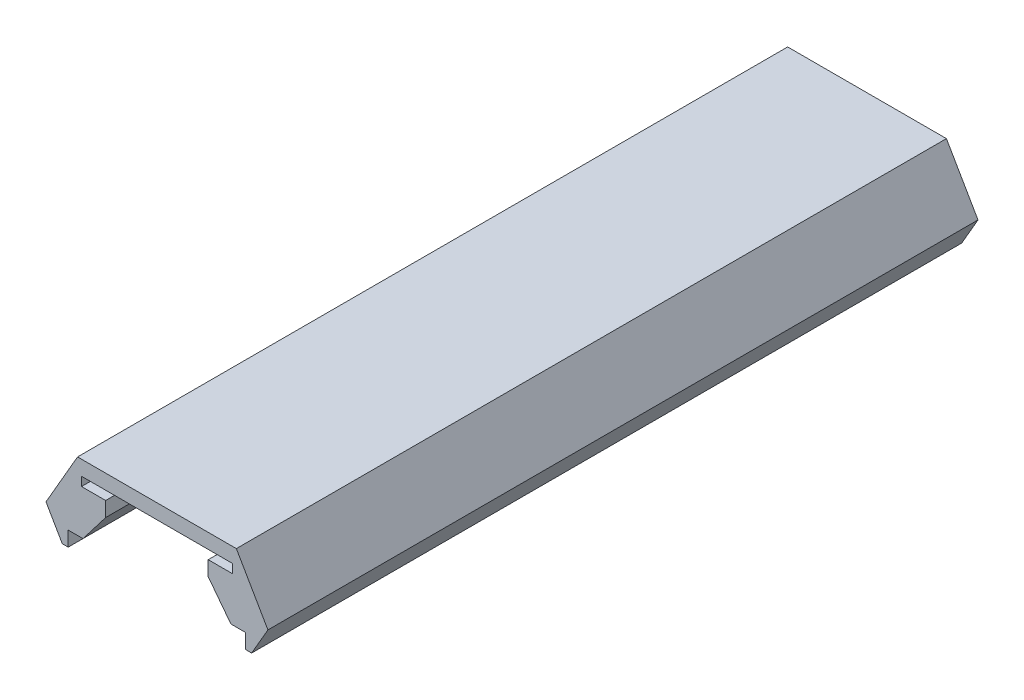
ISO-10303-21;
HEADER;
FILE_DESCRIPTION(('STEP AP214'),'2;1');
FILE_NAME('part.step','',(''),(''),'','','');
FILE_SCHEMA(('AUTOMOTIVE_DESIGN { 1 0 10303 214 1 1 1 1 }'));
ENDSEC;
DATA;
#1=APPLICATION_CONTEXT('core data for automotive mechanical design processes');
#2=APPLICATION_PROTOCOL_DEFINITION('international standard','automotive_design',2000,#1);
#3=PRODUCT_CONTEXT('',#1,'mechanical');
#4=PRODUCT('Part','Part','',(#3));
#5=PRODUCT_RELATED_PRODUCT_CATEGORY('part','',(#4));
#6=PRODUCT_DEFINITION_FORMATION('','',#4);
#7=PRODUCT_DEFINITION_CONTEXT('part definition',#1,'design');
#8=PRODUCT_DEFINITION('design','',#6,#7);
#9=PRODUCT_DEFINITION_SHAPE('','',#8);
#10=(LENGTH_UNIT() NAMED_UNIT(*) SI_UNIT(.MILLI.,.METRE.));
#11=(NAMED_UNIT(*) PLANE_ANGLE_UNIT() SI_UNIT($,.RADIAN.));
#12=(NAMED_UNIT(*) SI_UNIT($,.STERADIAN.) SOLID_ANGLE_UNIT());
#13=UNCERTAINTY_MEASURE_WITH_UNIT(LENGTH_MEASURE(1.E-05),#10,'distance_accuracy_value','');
#14=(GEOMETRIC_REPRESENTATION_CONTEXT(3) GLOBAL_UNCERTAINTY_ASSIGNED_CONTEXT((#13)) GLOBAL_UNIT_ASSIGNED_CONTEXT((#10,
#11,#12)) REPRESENTATION_CONTEXT('',''));
#15=CARTESIAN_POINT('',(0.,0.,0.));
#16=DIRECTION('',(0.,0.,1.));
#17=DIRECTION('',(1.,0.,0.));
#18=AXIS2_PLACEMENT_3D('',#15,#16,#17);
#19=CARTESIAN_POINT('',(5.36683849253808,1.,24.));
#20=DIRECTION('',(0.,-1.,0.));
#21=DIRECTION('',(0.,0.,-1.));
#22=AXIS2_PLACEMENT_3D('',#19,#20,#21);
#23=PLANE('',#22);
#24=DIRECTION('',(-1.,0.,0.));
#25=VECTOR('',#24,1.);
#26=CARTESIAN_POINT('',(5.36683849253808,1.,-24.));
#27=LINE('',#26,#25);
#28=CARTESIAN_POINT('',(5.36683849253808,1.,-24.));
#29=VERTEX_POINT('',#28);
#30=CARTESIAN_POINT('',(-5.36683849253808,1.,-24.));
#31=VERTEX_POINT('',#30);
#32=EDGE_CURVE('E201',#29,#31,#27,.T.);
#33=ORIENTED_EDGE('',*,*,#32,.T.);
#34=DIRECTION('',(0.,0.,-1.));
#35=VECTOR('',#34,1.);
#36=CARTESIAN_POINT('',(-5.36683849253808,1.,24.));
#37=LINE('',#36,#35);
#38=CARTESIAN_POINT('',(-5.36683849253808,1.,24.));
#39=VERTEX_POINT('',#38);
#40=EDGE_CURVE('E11',#39,#31,#37,.T.);
#41=ORIENTED_EDGE('',*,*,#40,.F.);
#42=DIRECTION('',(-1.,0.,0.));
#43=VECTOR('',#42,1.);
#44=CARTESIAN_POINT('',(5.36683849253808,1.,24.));
#45=LINE('',#44,#43);
#46=CARTESIAN_POINT('',(5.36683849253808,1.,24.));
#47=VERTEX_POINT('',#46);
#48=EDGE_CURVE('E239',#47,#39,#45,.T.);
#49=ORIENTED_EDGE('',*,*,#48,.F.);
#50=DIRECTION('',(0.,0.,-1.));
#51=VECTOR('',#50,1.);
#52=CARTESIAN_POINT('',(5.36683849253808,1.,24.));
#53=LINE('',#52,#51);
#54=EDGE_CURVE('E197',#47,#29,#53,.T.);
#55=ORIENTED_EDGE('',*,*,#54,.T.);
#56=EDGE_LOOP('',(#33,#41,#49,#55));
#57=FACE_BOUND('',#56,.T.);
#58=ADVANCED_FACE('F33',(#57),#23,.F.);
#59=CARTESIAN_POINT('',(-5.36683849253808,1.,24.));
#60=DIRECTION('',(0.866025403784437,-0.500000000000004,0.));
#61=DIRECTION('',(0.500000000000004,0.866025403784437,0.));
#62=AXIS2_PLACEMENT_3D('',#59,#60,#61);
#63=PLANE('',#62);
#64=DIRECTION('',(-0.500000000000004,-0.866025403784436,0.));
#65=VECTOR('',#64,1.);
#66=CARTESIAN_POINT('',(-5.36683849253808,1.,-24.));
#67=LINE('',#66,#65);
#68=CARTESIAN_POINT('',(-7.5,-2.69474411167423,-24.));
#69=VERTEX_POINT('',#68);
#70=EDGE_CURVE('E204',#31,#69,#67,.T.);
#71=ORIENTED_EDGE('',*,*,#70,.T.);
#72=DIRECTION('',(0.,0.,-1.));
#73=VECTOR('',#72,1.);
#74=CARTESIAN_POINT('',(-7.5,-2.69474411167423,24.));
#75=LINE('',#74,#73);
#76=CARTESIAN_POINT('',(-7.5,-2.69474411167423,24.));
#77=VERTEX_POINT('',#76);
#78=EDGE_CURVE('E41',#77,#69,#75,.T.);
#79=ORIENTED_EDGE('',*,*,#78,.F.);
#80=DIRECTION('',(-0.500000000000004,-0.866025403784436,0.));
#81=VECTOR('',#80,1.);
#82=CARTESIAN_POINT('',(-5.36683849253808,1.,24.));
#83=LINE('',#82,#81);
#84=EDGE_CURVE('E128',#39,#77,#83,.T.);
#85=ORIENTED_EDGE('',*,*,#84,.F.);
#86=ORIENTED_EDGE('',*,*,#40,.T.);
#87=EDGE_LOOP('',(#71,#79,#85,#86));
#88=FACE_BOUND('',#87,.T.);
#89=ADVANCED_FACE('F357',(#88),#63,.F.);
#90=CARTESIAN_POINT('',(-7.5,-2.69474411167423,24.));
#91=DIRECTION('',(0.86602540378444,0.499999999999998,0.));
#92=DIRECTION('',(-0.499999999999998,0.86602540378444,0.));
#93=AXIS2_PLACEMENT_3D('',#90,#91,#92);
#94=PLANE('',#93);
#95=DIRECTION('',(0.499999999999998,-0.86602540378444,0.));
#96=VECTOR('',#95,1.);
#97=CARTESIAN_POINT('',(-7.5,-2.69474411167423,-24.));
#98=LINE('',#97,#96);
#99=CARTESIAN_POINT('',(-6.4,-4.6,-24.));
#100=VERTEX_POINT('',#99);
#101=EDGE_CURVE('E206',#69,#100,#98,.T.);
#102=ORIENTED_EDGE('',*,*,#101,.T.);
#103=DIRECTION('',(0.,0.,-1.));
#104=VECTOR('',#103,1.);
#105=CARTESIAN_POINT('',(-6.4,-4.6,24.));
#106=LINE('',#105,#104);
#107=CARTESIAN_POINT('',(-6.4,-4.6,24.));
#108=VERTEX_POINT('',#107);
#109=EDGE_CURVE('E282',#108,#100,#106,.T.);
#110=ORIENTED_EDGE('',*,*,#109,.F.);
#111=DIRECTION('',(0.499999999999998,-0.86602540378444,0.));
#112=VECTOR('',#111,1.);
#113=CARTESIAN_POINT('',(-7.5,-2.69474411167423,24.));
#114=LINE('',#113,#112);
#115=EDGE_CURVE('E290',#77,#108,#114,.T.);
#116=ORIENTED_EDGE('',*,*,#115,.F.);
#117=ORIENTED_EDGE('',*,*,#78,.T.);
#118=EDGE_LOOP('',(#102,#110,#116,#117));
#119=FACE_BOUND('',#118,.T.);
#120=ADVANCED_FACE('F288',(#119),#94,.F.);
#121=CARTESIAN_POINT('',(-6.4,-4.6,24.));
#122=DIRECTION('',(0.,1.,0.));
#123=DIRECTION('',(0.,0.,1.));
#124=AXIS2_PLACEMENT_3D('',#121,#122,#123);
#125=PLANE('',#124);
#126=DIRECTION('',(1.,0.,0.));
#127=VECTOR('',#126,1.);
#128=CARTESIAN_POINT('',(-6.4,-4.6,-24.));
#129=LINE('',#128,#127);
#130=CARTESIAN_POINT('',(-6.,-4.6,-24.));
#131=VERTEX_POINT('',#130);
#132=EDGE_CURVE('E208',#100,#131,#129,.T.);
#133=ORIENTED_EDGE('',*,*,#132,.T.);
#134=DIRECTION('',(0.,0.,-1.));
#135=VECTOR('',#134,1.);
#136=CARTESIAN_POINT('',(-6.,-4.6,24.));
#137=LINE('',#136,#135);
#138=CARTESIAN_POINT('',(-6.,-4.6,24.));
#139=VERTEX_POINT('',#138);
#140=EDGE_CURVE('E279',#139,#131,#137,.T.);
#141=ORIENTED_EDGE('',*,*,#140,.F.);
#142=DIRECTION('',(1.,0.,0.));
#143=VECTOR('',#142,1.);
#144=CARTESIAN_POINT('',(-6.4,-4.6,24.));
#145=LINE('',#144,#143);
#146=EDGE_CURVE('E308',#108,#139,#145,.T.);
#147=ORIENTED_EDGE('',*,*,#146,.F.);
#148=ORIENTED_EDGE('',*,*,#109,.T.);
#149=EDGE_LOOP('',(#133,#141,#147,#148));
#150=FACE_BOUND('',#149,.T.);
#151=ADVANCED_FACE('F299',(#150),#125,.F.);
#152=CARTESIAN_POINT('',(-6.,-4.6,24.));
#153=DIRECTION('',(-1.,0.,0.));
#154=DIRECTION('',(0.,0.,1.));
#155=AXIS2_PLACEMENT_3D('',#152,#153,#154);
#156=PLANE('',#155);
#157=DIRECTION('',(0.,1.,0.));
#158=VECTOR('',#157,1.);
#159=CARTESIAN_POINT('',(-6.,-4.6,-24.));
#160=LINE('',#159,#158);
#161=CARTESIAN_POINT('',(-6.,-3.6,-24.));
#162=VERTEX_POINT('',#161);
#163=EDGE_CURVE('E210',#131,#162,#160,.T.);
#164=ORIENTED_EDGE('',*,*,#163,.T.);
#165=DIRECTION('',(0.,0.,-1.));
#166=VECTOR('',#165,1.);
#167=CARTESIAN_POINT('',(-6.,-3.6,24.));
#168=LINE('',#167,#166);
#169=CARTESIAN_POINT('',(-6.,-3.6,24.));
#170=VERTEX_POINT('',#169);
#171=EDGE_CURVE('E276',#170,#162,#168,.T.);
#172=ORIENTED_EDGE('',*,*,#171,.F.);
#173=DIRECTION('',(0.,1.,0.));
#174=VECTOR('',#173,1.);
#175=CARTESIAN_POINT('',(-6.,-4.6,24.));
#176=LINE('',#175,#174);
#177=EDGE_CURVE('E305',#139,#170,#176,.T.);
#178=ORIENTED_EDGE('',*,*,#177,.F.);
#179=ORIENTED_EDGE('',*,*,#140,.T.);
#180=EDGE_LOOP('',(#164,#172,#178,#179));
#181=FACE_BOUND('',#180,.T.);
#182=ADVANCED_FACE('F303',(#181),#156,.F.);
#183=CARTESIAN_POINT('',(-6.,-3.6,24.));
#184=DIRECTION('',(0.,1.,0.));
#185=DIRECTION('',(0.,0.,1.));
#186=AXIS2_PLACEMENT_3D('',#183,#184,#185);
#187=PLANE('',#186);
#188=DIRECTION('',(1.,0.,0.));
#189=VECTOR('',#188,1.);
#190=CARTESIAN_POINT('',(-6.,-3.6,-24.));
#191=LINE('',#190,#189);
#192=CARTESIAN_POINT('',(-5.,-3.6,-24.));
#193=VERTEX_POINT('',#192);
#194=EDGE_CURVE('E212',#162,#193,#191,.T.);
#195=ORIENTED_EDGE('',*,*,#194,.T.);
#196=DIRECTION('',(0.,0.,-1.));
#197=VECTOR('',#196,1.);
#198=CARTESIAN_POINT('',(-5.,-3.6,24.));
#199=LINE('',#198,#197);
#200=CARTESIAN_POINT('',(-5.,-3.6,24.));
#201=VERTEX_POINT('',#200);
#202=EDGE_CURVE('E273',#201,#193,#199,.T.);
#203=ORIENTED_EDGE('',*,*,#202,.F.);
#204=DIRECTION('',(1.,0.,0.));
#205=VECTOR('',#204,1.);
#206=CARTESIAN_POINT('',(-6.,-3.6,24.));
#207=LINE('',#206,#205);
#208=EDGE_CURVE('E307',#170,#201,#207,.T.);
#209=ORIENTED_EDGE('',*,*,#208,.F.);
#210=ORIENTED_EDGE('',*,*,#171,.T.);
#211=EDGE_LOOP('',(#195,#203,#209,#210));
#212=FACE_BOUND('',#211,.T.);
#213=ADVANCED_FACE('F370',(#212),#187,.F.);
#214=CARTESIAN_POINT('',(-5.,-3.6,24.));
#215=DIRECTION('',(-0.793656614758769,0.60836599005011,0.));
#216=DIRECTION('',(-0.60836599005011,-0.793656614758769,0.));
#217=AXIS2_PLACEMENT_3D('',#214,#215,#216);
#218=PLANE('',#217);
#219=DIRECTION('',(0.60836599005011,0.793656614758769,0.));
#220=VECTOR('',#219,1.);
#221=CARTESIAN_POINT('',(-5.,-3.6,-24.));
#222=LINE('',#221,#220);
#223=CARTESIAN_POINT('',(-3.46692894953059,-1.6,-24.));
#224=VERTEX_POINT('',#223);
#225=EDGE_CURVE('E214',#193,#224,#222,.T.);
#226=ORIENTED_EDGE('',*,*,#225,.T.);
#227=DIRECTION('',(0.,0.,-1.));
#228=VECTOR('',#227,1.);
#229=CARTESIAN_POINT('',(-3.46692894953059,-1.6,24.));
#230=LINE('',#229,#228);
#231=CARTESIAN_POINT('',(-3.46692894953059,-1.6,24.));
#232=VERTEX_POINT('',#231);
#233=EDGE_CURVE('E270',#232,#224,#230,.T.);
#234=ORIENTED_EDGE('',*,*,#233,.F.);
#235=DIRECTION('',(0.60836599005011,0.793656614758769,0.));
#236=VECTOR('',#235,1.);
#237=CARTESIAN_POINT('',(-5.,-3.6,24.));
#238=LINE('',#237,#236);
#239=EDGE_CURVE('E310',#201,#232,#238,.T.);
#240=ORIENTED_EDGE('',*,*,#239,.F.);
#241=ORIENTED_EDGE('',*,*,#202,.T.);
#242=EDGE_LOOP('',(#226,#234,#240,#241));
#243=FACE_BOUND('',#242,.T.);
#244=ADVANCED_FACE('F373',(#243),#218,.F.);
#245=CARTESIAN_POINT('',(-3.46692894953059,-1.6,24.));
#246=DIRECTION('',(-1.,0.,0.));
#247=DIRECTION('',(0.,-1.,0.));
#248=AXIS2_PLACEMENT_3D('',#245,#246,#247);
#249=PLANE('',#248);
#250=DIRECTION('',(0.,1.,0.));
#251=VECTOR('',#250,1.);
#252=CARTESIAN_POINT('',(-3.46692894953059,-1.6,-24.));
#253=LINE('',#252,#251);
#254=CARTESIAN_POINT('',(-3.46692894953059,-0.6,-24.));
#255=VERTEX_POINT('',#254);
#256=EDGE_CURVE('E216',#224,#255,#253,.T.);
#257=ORIENTED_EDGE('',*,*,#256,.T.);
#258=DIRECTION('',(0.,0.,-1.));
#259=VECTOR('',#258,1.);
#260=CARTESIAN_POINT('',(-3.46692894953059,-0.6,24.));
#261=LINE('',#260,#259);
#262=CARTESIAN_POINT('',(-3.46692894953059,-0.6,24.));
#263=VERTEX_POINT('',#262);
#264=EDGE_CURVE('E267',#263,#255,#261,.T.);
#265=ORIENTED_EDGE('',*,*,#264,.F.);
#266=DIRECTION('',(0.,1.,0.));
#267=VECTOR('',#266,1.);
#268=CARTESIAN_POINT('',(-3.46692894953059,-1.6,24.));
#269=LINE('',#268,#267);
#270=EDGE_CURVE('E316',#232,#263,#269,.T.);
#271=ORIENTED_EDGE('',*,*,#270,.F.);
#272=ORIENTED_EDGE('',*,*,#233,.T.);
#273=EDGE_LOOP('',(#257,#265,#271,#272));
#274=FACE_BOUND('',#273,.T.);
#275=ADVANCED_FACE('F377',(#274),#249,.F.);
#276=CARTESIAN_POINT('',(-3.46692894953059,-0.6,24.));
#277=DIRECTION('',(0.,-1.,0.));
#278=DIRECTION('',(1.,0.,0.));
#279=AXIS2_PLACEMENT_3D('',#276,#277,#278);
#280=PLANE('',#279);
#281=DIRECTION('',(-1.,0.,0.));
#282=VECTOR('',#281,1.);
#283=CARTESIAN_POINT('',(-3.46692894953059,-0.6,-24.));
#284=LINE('',#283,#282);
#285=CARTESIAN_POINT('',(-5.1,-0.6,-24.));
#286=VERTEX_POINT('',#285);
#287=EDGE_CURVE('E218',#255,#286,#284,.T.);
#288=ORIENTED_EDGE('',*,*,#287,.T.);
#289=DIRECTION('',(0.,0.,-1.));
#290=VECTOR('',#289,1.);
#291=CARTESIAN_POINT('',(-5.1,-0.6,24.));
#292=LINE('',#291,#290);
#293=CARTESIAN_POINT('',(-5.1,-0.6,24.));
#294=VERTEX_POINT('',#293);
#295=EDGE_CURVE('E264',#294,#286,#292,.T.);
#296=ORIENTED_EDGE('',*,*,#295,.F.);
#297=DIRECTION('',(-1.,0.,0.));
#298=VECTOR('',#297,1.);
#299=CARTESIAN_POINT('',(-3.46692894953059,-0.6,24.));
#300=LINE('',#299,#298);
#301=EDGE_CURVE('E318',#263,#294,#300,.T.);
#302=ORIENTED_EDGE('',*,*,#301,.F.);
#303=ORIENTED_EDGE('',*,*,#264,.T.);
#304=EDGE_LOOP('',(#288,#296,#302,#303));
#305=FACE_BOUND('',#304,.T.);
#306=ADVANCED_FACE('F381',(#305),#280,.F.);
#307=CARTESIAN_POINT('',(-5.1,-0.6,24.));
#308=DIRECTION('',(-1.,0.,0.));
#309=DIRECTION('',(0.,0.,1.));
#310=AXIS2_PLACEMENT_3D('',#307,#308,#309);
#311=PLANE('',#310);
#312=DIRECTION('',(0.,1.,0.));
#313=VECTOR('',#312,1.);
#314=CARTESIAN_POINT('',(-5.1,-0.6,-24.));
#315=LINE('',#314,#313);
#316=CARTESIAN_POINT('',(-5.1,0.,-24.));
#317=VERTEX_POINT('',#316);
#318=EDGE_CURVE('E220',#286,#317,#315,.T.);
#319=ORIENTED_EDGE('',*,*,#318,.T.);
#320=DIRECTION('',(0.,0.,-1.));
#321=VECTOR('',#320,1.);
#322=CARTESIAN_POINT('',(-5.1,0.,24.));
#323=LINE('',#322,#321);
#324=CARTESIAN_POINT('',(-5.1,0.,24.));
#325=VERTEX_POINT('',#324);
#326=EDGE_CURVE('E261',#325,#317,#323,.T.);
#327=ORIENTED_EDGE('',*,*,#326,.F.);
#328=DIRECTION('',(0.,1.,0.));
#329=VECTOR('',#328,1.);
#330=CARTESIAN_POINT('',(-5.1,-0.6,24.));
#331=LINE('',#330,#329);
#332=EDGE_CURVE('E320',#294,#325,#331,.T.);
#333=ORIENTED_EDGE('',*,*,#332,.F.);
#334=ORIENTED_EDGE('',*,*,#295,.T.);
#335=EDGE_LOOP('',(#319,#327,#333,#334));
#336=FACE_BOUND('',#335,.T.);
#337=ADVANCED_FACE('F385',(#336),#311,.F.);
#338=CARTESIAN_POINT('',(-5.1,0.,24.));
#339=DIRECTION('',(0.,1.,0.));
#340=DIRECTION('',(0.,0.,1.));
#341=AXIS2_PLACEMENT_3D('',#338,#339,#340);
#342=PLANE('',#341);
#343=DIRECTION('',(1.,0.,0.));
#344=VECTOR('',#343,1.);
#345=CARTESIAN_POINT('',(-5.1,0.,-24.));
#346=LINE('',#345,#344);
#347=CARTESIAN_POINT('',(5.1,0.,-24.));
#348=VERTEX_POINT('',#347);
#349=EDGE_CURVE('E222',#317,#348,#346,.T.);
#350=ORIENTED_EDGE('',*,*,#349,.T.);
#351=DIRECTION('',(0.,0.,-1.));
#352=VECTOR('',#351,1.);
#353=CARTESIAN_POINT('',(5.1,0.,24.));
#354=LINE('',#353,#352);
#355=CARTESIAN_POINT('',(5.1,0.,24.));
#356=VERTEX_POINT('',#355);
#357=EDGE_CURVE('E258',#356,#348,#354,.T.);
#358=ORIENTED_EDGE('',*,*,#357,.F.);
#359=DIRECTION('',(1.,0.,0.));
#360=VECTOR('',#359,1.);
#361=CARTESIAN_POINT('',(-5.1,0.,24.));
#362=LINE('',#361,#360);
#363=EDGE_CURVE('E322',#325,#356,#362,.T.);
#364=ORIENTED_EDGE('',*,*,#363,.F.);
#365=ORIENTED_EDGE('',*,*,#326,.T.);
#366=EDGE_LOOP('',(#350,#358,#364,#365));
#367=FACE_BOUND('',#366,.T.);
#368=ADVANCED_FACE('F389',(#367),#342,.F.);
#369=CARTESIAN_POINT('',(5.1,0.,24.));
#370=DIRECTION('',(1.,0.,0.));
#371=DIRECTION('',(0.,0.,-1.));
#372=AXIS2_PLACEMENT_3D('',#369,#370,#371);
#373=PLANE('',#372);
#374=DIRECTION('',(0.,-1.,0.));
#375=VECTOR('',#374,1.);
#376=CARTESIAN_POINT('',(5.1,0.,-24.));
#377=LINE('',#376,#375);
#378=CARTESIAN_POINT('',(5.1,-0.6,-24.));
#379=VERTEX_POINT('',#378);
#380=EDGE_CURVE('E224',#348,#379,#377,.T.);
#381=ORIENTED_EDGE('',*,*,#380,.T.);
#382=DIRECTION('',(0.,0.,-1.));
#383=VECTOR('',#382,1.);
#384=CARTESIAN_POINT('',(5.1,-0.6,24.));
#385=LINE('',#384,#383);
#386=CARTESIAN_POINT('',(5.1,-0.6,24.));
#387=VERTEX_POINT('',#386);
#388=EDGE_CURVE('E255',#387,#379,#385,.T.);
#389=ORIENTED_EDGE('',*,*,#388,.F.);
#390=DIRECTION('',(0.,-1.,0.));
#391=VECTOR('',#390,1.);
#392=CARTESIAN_POINT('',(5.1,0.,24.));
#393=LINE('',#392,#391);
#394=EDGE_CURVE('E324',#356,#387,#393,.T.);
#395=ORIENTED_EDGE('',*,*,#394,.F.);
#396=ORIENTED_EDGE('',*,*,#357,.T.);
#397=EDGE_LOOP('',(#381,#389,#395,#396));
#398=FACE_BOUND('',#397,.T.);
#399=ADVANCED_FACE('F393',(#398),#373,.F.);
#400=CARTESIAN_POINT('',(5.1,-0.6,24.));
#401=DIRECTION('',(0.,-1.,0.));
#402=DIRECTION('',(1.,0.,0.));
#403=AXIS2_PLACEMENT_3D('',#400,#401,#402);
#404=PLANE('',#403);
#405=DIRECTION('',(-1.,0.,0.));
#406=VECTOR('',#405,1.);
#407=CARTESIAN_POINT('',(5.1,-0.6,-24.));
#408=LINE('',#407,#406);
#409=CARTESIAN_POINT('',(3.46692894953059,-0.6,-24.));
#410=VERTEX_POINT('',#409);
#411=EDGE_CURVE('E226',#379,#410,#408,.T.);
#412=ORIENTED_EDGE('',*,*,#411,.T.);
#413=DIRECTION('',(0.,0.,-1.));
#414=VECTOR('',#413,1.);
#415=CARTESIAN_POINT('',(3.46692894953059,-0.6,24.));
#416=LINE('',#415,#414);
#417=CARTESIAN_POINT('',(3.46692894953059,-0.6,24.));
#418=VERTEX_POINT('',#417);
#419=EDGE_CURVE('E252',#418,#410,#416,.T.);
#420=ORIENTED_EDGE('',*,*,#419,.F.);
#421=DIRECTION('',(-1.,0.,0.));
#422=VECTOR('',#421,1.);
#423=CARTESIAN_POINT('',(5.1,-0.6,24.));
#424=LINE('',#423,#422);
#425=EDGE_CURVE('E326',#387,#418,#424,.T.);
#426=ORIENTED_EDGE('',*,*,#425,.F.);
#427=ORIENTED_EDGE('',*,*,#388,.T.);
#428=EDGE_LOOP('',(#412,#420,#426,#427));
#429=FACE_BOUND('',#428,.T.);
#430=ADVANCED_FACE('F397',(#429),#404,.F.);
#431=CARTESIAN_POINT('',(3.46692894953059,-0.6,24.));
#432=DIRECTION('',(1.,0.,0.));
#433=DIRECTION('',(0.,1.,0.));
#434=AXIS2_PLACEMENT_3D('',#431,#432,#433);
#435=PLANE('',#434);
#436=DIRECTION('',(0.,-1.,0.));
#437=VECTOR('',#436,1.);
#438=CARTESIAN_POINT('',(3.46692894953059,-0.6,-24.));
#439=LINE('',#438,#437);
#440=CARTESIAN_POINT('',(3.46692894953059,-1.6,-24.));
#441=VERTEX_POINT('',#440);
#442=EDGE_CURVE('E228',#410,#441,#439,.T.);
#443=ORIENTED_EDGE('',*,*,#442,.T.);
#444=DIRECTION('',(0.,0.,-1.));
#445=VECTOR('',#444,1.);
#446=CARTESIAN_POINT('',(3.46692894953059,-1.6,24.));
#447=LINE('',#446,#445);
#448=CARTESIAN_POINT('',(3.46692894953059,-1.6,24.));
#449=VERTEX_POINT('',#448);
#450=EDGE_CURVE('E249',#449,#441,#447,.T.);
#451=ORIENTED_EDGE('',*,*,#450,.F.);
#452=DIRECTION('',(0.,-1.,0.));
#453=VECTOR('',#452,1.);
#454=CARTESIAN_POINT('',(3.46692894953059,-0.6,24.));
#455=LINE('',#454,#453);
#456=EDGE_CURVE('E328',#418,#449,#455,.T.);
#457=ORIENTED_EDGE('',*,*,#456,.F.);
#458=ORIENTED_EDGE('',*,*,#419,.T.);
#459=EDGE_LOOP('',(#443,#451,#457,#458));
#460=FACE_BOUND('',#459,.T.);
#461=ADVANCED_FACE('F401',(#460),#435,.F.);
#462=CARTESIAN_POINT('',(3.46692894953059,-1.6,24.));
#463=DIRECTION('',(0.793656614758769,0.60836599005011,0.));
#464=DIRECTION('',(-0.60836599005011,0.793656614758769,0.));
#465=AXIS2_PLACEMENT_3D('',#462,#463,#464);
#466=PLANE('',#465);
#467=DIRECTION('',(0.60836599005011,-0.793656614758769,0.));
#468=VECTOR('',#467,1.);
#469=CARTESIAN_POINT('',(3.46692894953059,-1.6,-24.));
#470=LINE('',#469,#468);
#471=CARTESIAN_POINT('',(5.,-3.6,-24.));
#472=VERTEX_POINT('',#471);
#473=EDGE_CURVE('E230',#441,#472,#470,.T.);
#474=ORIENTED_EDGE('',*,*,#473,.T.);
#475=DIRECTION('',(0.,0.,-1.));
#476=VECTOR('',#475,1.);
#477=CARTESIAN_POINT('',(5.,-3.6,24.));
#478=LINE('',#477,#476);
#479=CARTESIAN_POINT('',(5.,-3.6,24.));
#480=VERTEX_POINT('',#479);
#481=EDGE_CURVE('E246',#480,#472,#478,.T.);
#482=ORIENTED_EDGE('',*,*,#481,.F.);
#483=DIRECTION('',(0.60836599005011,-0.793656614758769,0.));
#484=VECTOR('',#483,1.);
#485=CARTESIAN_POINT('',(3.46692894953059,-1.6,24.));
#486=LINE('',#485,#484);
#487=EDGE_CURVE('E330',#449,#480,#486,.T.);
#488=ORIENTED_EDGE('',*,*,#487,.F.);
#489=ORIENTED_EDGE('',*,*,#450,.T.);
#490=EDGE_LOOP('',(#474,#482,#488,#489));
#491=FACE_BOUND('',#490,.T.);
#492=ADVANCED_FACE('F405',(#491),#466,.F.);
#493=CARTESIAN_POINT('',(5.,-3.6,24.));
#494=DIRECTION('',(0.,1.,0.));
#495=DIRECTION('',(0.,0.,1.));
#496=AXIS2_PLACEMENT_3D('',#493,#494,#495);
#497=PLANE('',#496);
#498=DIRECTION('',(1.,0.,0.));
#499=VECTOR('',#498,1.);
#500=CARTESIAN_POINT('',(5.,-3.6,-24.));
#501=LINE('',#500,#499);
#502=CARTESIAN_POINT('',(6.,-3.6,-24.));
#503=VERTEX_POINT('',#502);
#504=EDGE_CURVE('E232',#472,#503,#501,.T.);
#505=ORIENTED_EDGE('',*,*,#504,.T.);
#506=DIRECTION('',(0.,0.,-1.));
#507=VECTOR('',#506,1.);
#508=CARTESIAN_POINT('',(6.,-3.6,24.));
#509=LINE('',#508,#507);
#510=CARTESIAN_POINT('',(6.,-3.6,24.));
#511=VERTEX_POINT('',#510);
#512=EDGE_CURVE('E243',#511,#503,#509,.T.);
#513=ORIENTED_EDGE('',*,*,#512,.F.);
#514=DIRECTION('',(1.,0.,0.));
#515=VECTOR('',#514,1.);
#516=CARTESIAN_POINT('',(5.,-3.6,24.));
#517=LINE('',#516,#515);
#518=EDGE_CURVE('E332',#480,#511,#517,.T.);
#519=ORIENTED_EDGE('',*,*,#518,.F.);
#520=ORIENTED_EDGE('',*,*,#481,.T.);
#521=EDGE_LOOP('',(#505,#513,#519,#520));
#522=FACE_BOUND('',#521,.T.);
#523=ADVANCED_FACE('F338',(#522),#497,.F.);
#524=CARTESIAN_POINT('',(6.,-3.6,24.));
#525=DIRECTION('',(1.,0.,0.));
#526=DIRECTION('',(0.,0.,-1.));
#527=AXIS2_PLACEMENT_3D('',#524,#525,#526);
#528=PLANE('',#527);
#529=DIRECTION('',(0.,-1.,0.));
#530=VECTOR('',#529,1.);
#531=CARTESIAN_POINT('',(6.,-3.6,-24.));
#532=LINE('',#531,#530);
#533=CARTESIAN_POINT('',(6.,-4.6,-24.));
#534=VERTEX_POINT('',#533);
#535=EDGE_CURVE('E234',#503,#534,#532,.T.);
#536=ORIENTED_EDGE('',*,*,#535,.T.);
#537=DIRECTION('',(0.,0.,-1.));
#538=VECTOR('',#537,1.);
#539=CARTESIAN_POINT('',(6.,-4.6,24.));
#540=LINE('',#539,#538);
#541=CARTESIAN_POINT('',(6.,-4.6,24.));
#542=VERTEX_POINT('',#541);
#543=EDGE_CURVE('E192',#542,#534,#540,.T.);
#544=ORIENTED_EDGE('',*,*,#543,.F.);
#545=DIRECTION('',(0.,-1.,0.));
#546=VECTOR('',#545,1.);
#547=CARTESIAN_POINT('',(6.,-3.6,24.));
#548=LINE('',#547,#546);
#549=EDGE_CURVE('E183',#511,#542,#548,.T.);
#550=ORIENTED_EDGE('',*,*,#549,.F.);
#551=ORIENTED_EDGE('',*,*,#512,.T.);
#552=EDGE_LOOP('',(#536,#544,#550,#551));
#553=FACE_BOUND('',#552,.T.);
#554=ADVANCED_FACE('F342',(#553),#528,.F.);
#555=CARTESIAN_POINT('',(6.,-4.6,24.));
#556=DIRECTION('',(0.,1.,0.));
#557=DIRECTION('',(0.,0.,1.));
#558=AXIS2_PLACEMENT_3D('',#555,#556,#557);
#559=PLANE('',#558);
#560=DIRECTION('',(1.,0.,0.));
#561=VECTOR('',#560,1.);
#562=CARTESIAN_POINT('',(6.,-4.6,-24.));
#563=LINE('',#562,#561);
#564=CARTESIAN_POINT('',(6.4,-4.6,-24.));
#565=VERTEX_POINT('',#564);
#566=EDGE_CURVE('E191',#534,#565,#563,.T.);
#567=ORIENTED_EDGE('',*,*,#566,.T.);
#568=DIRECTION('',(0.,0.,-1.));
#569=VECTOR('',#568,1.);
#570=CARTESIAN_POINT('',(6.4,-4.6,24.));
#571=LINE('',#570,#569);
#572=CARTESIAN_POINT('',(6.4,-4.6,24.));
#573=VERTEX_POINT('',#572);
#574=EDGE_CURVE('E188',#573,#565,#571,.T.);
#575=ORIENTED_EDGE('',*,*,#574,.F.);
#576=DIRECTION('',(1.,0.,0.));
#577=VECTOR('',#576,1.);
#578=CARTESIAN_POINT('',(6.,-4.6,24.));
#579=LINE('',#578,#577);
#580=EDGE_CURVE('E177',#542,#573,#579,.T.);
#581=ORIENTED_EDGE('',*,*,#580,.F.);
#582=ORIENTED_EDGE('',*,*,#543,.T.);
#583=EDGE_LOOP('',(#567,#575,#581,#582));
#584=FACE_BOUND('',#583,.T.);
#585=ADVANCED_FACE('F189',(#584),#559,.F.);
#586=CARTESIAN_POINT('',(6.4,-4.6,24.));
#587=DIRECTION('',(-0.86602540378444,0.499999999999998,0.));
#588=DIRECTION('',(-0.499999999999998,-0.86602540378444,0.));
#589=AXIS2_PLACEMENT_3D('',#586,#587,#588);
#590=PLANE('',#589);
#591=DIRECTION('',(0.499999999999998,0.86602540378444,0.));
#592=VECTOR('',#591,1.);
#593=CARTESIAN_POINT('',(6.4,-4.6,-24.));
#594=LINE('',#593,#592);
#595=CARTESIAN_POINT('',(7.5,-2.69474411167423,-24.));
#596=VERTEX_POINT('',#595);
#597=EDGE_CURVE('E114',#565,#596,#594,.T.);
#598=ORIENTED_EDGE('',*,*,#597,.T.);
#599=DIRECTION('',(0.,0.,-1.));
#600=VECTOR('',#599,1.);
#601=CARTESIAN_POINT('',(7.5,-2.69474411167423,24.));
#602=LINE('',#601,#600);
#603=CARTESIAN_POINT('',(7.5,-2.69474411167423,24.));
#604=VERTEX_POINT('',#603);
#605=EDGE_CURVE('E193',#604,#596,#602,.T.);
#606=ORIENTED_EDGE('',*,*,#605,.F.);
#607=DIRECTION('',(0.499999999999998,0.86602540378444,0.));
#608=VECTOR('',#607,1.);
#609=CARTESIAN_POINT('',(6.4,-4.6,24.));
#610=LINE('',#609,#608);
#611=EDGE_CURVE('E181',#573,#604,#610,.T.);
#612=ORIENTED_EDGE('',*,*,#611,.F.);
#613=ORIENTED_EDGE('',*,*,#574,.T.);
#614=EDGE_LOOP('',(#598,#606,#612,#613));
#615=FACE_BOUND('',#614,.T.);
#616=ADVANCED_FACE('F195',(#615),#590,.F.);
#617=CARTESIAN_POINT('',(7.5,-2.69474411167423,24.));
#618=DIRECTION('',(-0.866025403784437,-0.500000000000004,0.));
#619=DIRECTION('',(0.500000000000004,-0.866025403784437,0.));
#620=AXIS2_PLACEMENT_3D('',#617,#618,#619);
#621=PLANE('',#620);
#622=DIRECTION('',(-0.500000000000004,0.866025403784436,0.));
#623=VECTOR('',#622,1.);
#624=CARTESIAN_POINT('',(7.5,-2.69474411167423,-24.));
#625=LINE('',#624,#623);
#626=EDGE_CURVE('E120',#596,#29,#625,.T.);
#627=ORIENTED_EDGE('',*,*,#626,.T.);
#628=ORIENTED_EDGE('',*,*,#54,.F.);
#629=DIRECTION('',(-0.500000000000004,0.866025403784436,0.));
#630=VECTOR('',#629,1.);
#631=CARTESIAN_POINT('',(7.5,-2.69474411167423,24.));
#632=LINE('',#631,#630);
#633=EDGE_CURVE('E49',#604,#47,#632,.T.);
#634=ORIENTED_EDGE('',*,*,#633,.F.);
#635=ORIENTED_EDGE('',*,*,#605,.T.);
#636=EDGE_LOOP('',(#627,#628,#634,#635));
#637=FACE_BOUND('',#636,.T.);
#638=ADVANCED_FACE('F346',(#637),#621,.F.);
#639=CARTESIAN_POINT('',(0.,0.,24.));
#640=DIRECTION('',(0.,0.,-1.));
#641=DIRECTION('',(-1.,0.,0.));
#642=AXIS2_PLACEMENT_3D('',#639,#640,#641);
#643=PLANE('',#642);
#644=ORIENTED_EDGE('',*,*,#48,.T.);
#645=ORIENTED_EDGE('',*,*,#84,.T.);
#646=ORIENTED_EDGE('',*,*,#115,.T.);
#647=ORIENTED_EDGE('',*,*,#146,.T.);
#648=ORIENTED_EDGE('',*,*,#177,.T.);
#649=ORIENTED_EDGE('',*,*,#208,.T.);
#650=ORIENTED_EDGE('',*,*,#239,.T.);
#651=ORIENTED_EDGE('',*,*,#270,.T.);
#652=ORIENTED_EDGE('',*,*,#301,.T.);
#653=ORIENTED_EDGE('',*,*,#332,.T.);
#654=ORIENTED_EDGE('',*,*,#363,.T.);
#655=ORIENTED_EDGE('',*,*,#394,.T.);
#656=ORIENTED_EDGE('',*,*,#425,.T.);
#657=ORIENTED_EDGE('',*,*,#456,.T.);
#658=ORIENTED_EDGE('',*,*,#487,.T.);
#659=ORIENTED_EDGE('',*,*,#518,.T.);
#660=ORIENTED_EDGE('',*,*,#549,.T.);
#661=ORIENTED_EDGE('',*,*,#580,.T.);
#662=ORIENTED_EDGE('',*,*,#611,.T.);
#663=ORIENTED_EDGE('',*,*,#633,.T.);
#664=EDGE_LOOP('',(#644,#645,#646,#647,#648,#649,#650,#651,#652,#653,#654,#655,#656,#657,#658,
#659,#660,#661,#662,#663));
#665=FACE_BOUND('',#664,.T.);
#666=ADVANCED_FACE('F179',(#665),#643,.F.);
#667=CARTESIAN_POINT('',(0.,0.,-24.));
#668=DIRECTION('',(0.,0.,-1.));
#669=DIRECTION('',(-1.,0.,0.));
#670=AXIS2_PLACEMENT_3D('',#667,#668,#669);
#671=PLANE('',#670);
#672=ORIENTED_EDGE('',*,*,#32,.F.);
#673=ORIENTED_EDGE('',*,*,#626,.F.);
#674=ORIENTED_EDGE('',*,*,#597,.F.);
#675=ORIENTED_EDGE('',*,*,#566,.F.);
#676=ORIENTED_EDGE('',*,*,#535,.F.);
#677=ORIENTED_EDGE('',*,*,#504,.F.);
#678=ORIENTED_EDGE('',*,*,#473,.F.);
#679=ORIENTED_EDGE('',*,*,#442,.F.);
#680=ORIENTED_EDGE('',*,*,#411,.F.);
#681=ORIENTED_EDGE('',*,*,#380,.F.);
#682=ORIENTED_EDGE('',*,*,#349,.F.);
#683=ORIENTED_EDGE('',*,*,#318,.F.);
#684=ORIENTED_EDGE('',*,*,#287,.F.);
#685=ORIENTED_EDGE('',*,*,#256,.F.);
#686=ORIENTED_EDGE('',*,*,#225,.F.);
#687=ORIENTED_EDGE('',*,*,#194,.F.);
#688=ORIENTED_EDGE('',*,*,#163,.F.);
#689=ORIENTED_EDGE('',*,*,#132,.F.);
#690=ORIENTED_EDGE('',*,*,#101,.F.);
#691=ORIENTED_EDGE('',*,*,#70,.F.);
#692=EDGE_LOOP('',(#672,#673,#674,#675,#676,#677,#678,#679,#680,#681,#682,#683,#684,#685,#686,
#687,#688,#689,#690,#691));
#693=FACE_BOUND('',#692,.T.);
#694=ADVANCED_FACE('F294',(#693),#671,.T.);
#695=CLOSED_SHELL('',(#58,#89,#120,#151,#182,#213,#244,#275,#306,#337,#368,#399,#430,#461,#492,
#523,#554,#585,#616,#638,#666,#694));
#696=MANIFOLD_SOLID_BREP('B2',#695);
#697=ADVANCED_BREP_SHAPE_REPRESENTATION('',(#18,#696),#14);
#698=SHAPE_DEFINITION_REPRESENTATION(#9,#697);
ENDSEC;
END-ISO-10303-21;
